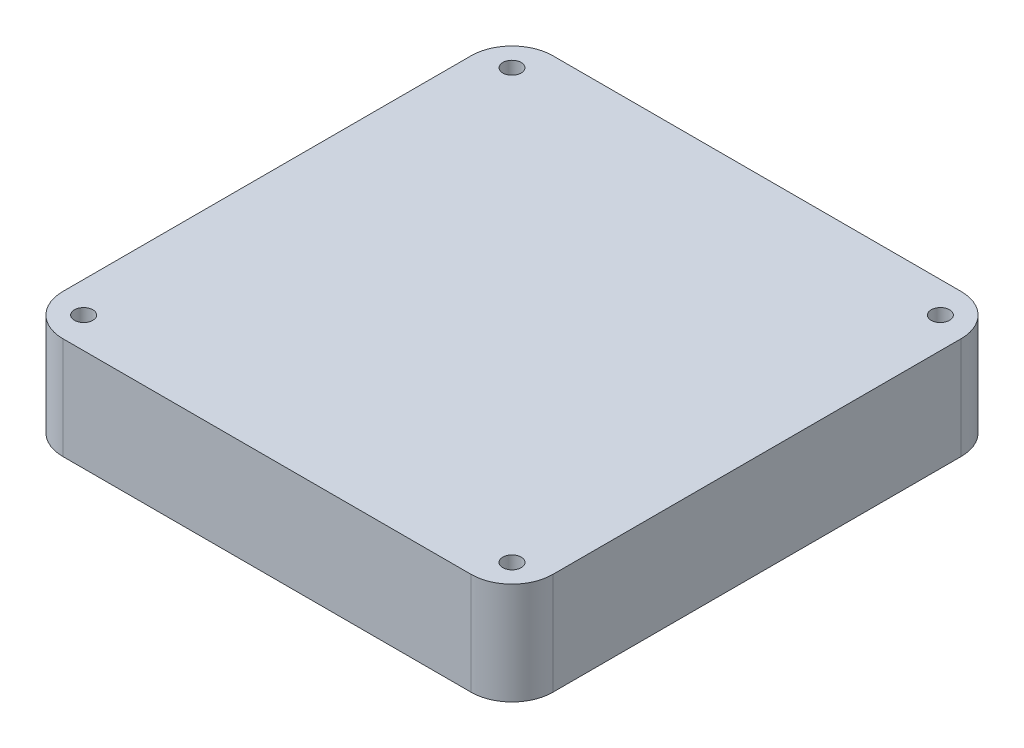
ISO-10303-21;
HEADER;
FILE_DESCRIPTION(('STEP AP214'),'2;1');
FILE_NAME('part.step','',(''),(''),'','','');
FILE_SCHEMA(('AUTOMOTIVE_DESIGN { 1 0 10303 214 1 1 1 1 }'));
ENDSEC;
DATA;
#1=APPLICATION_CONTEXT('core data for automotive mechanical design processes');
#2=APPLICATION_PROTOCOL_DEFINITION('international standard','automotive_design',2000,#1);
#3=PRODUCT_CONTEXT('',#1,'mechanical');
#4=PRODUCT('Part','Part','',(#3));
#5=PRODUCT_RELATED_PRODUCT_CATEGORY('part','',(#4));
#6=PRODUCT_DEFINITION_FORMATION('','',#4);
#7=PRODUCT_DEFINITION_CONTEXT('part definition',#1,'design');
#8=PRODUCT_DEFINITION('design','',#6,#7);
#9=PRODUCT_DEFINITION_SHAPE('','',#8);
#10=(LENGTH_UNIT() NAMED_UNIT(*) SI_UNIT(.MILLI.,.METRE.));
#11=(NAMED_UNIT(*) PLANE_ANGLE_UNIT() SI_UNIT($,.RADIAN.));
#12=(NAMED_UNIT(*) SI_UNIT($,.STERADIAN.) SOLID_ANGLE_UNIT());
#13=UNCERTAINTY_MEASURE_WITH_UNIT(LENGTH_MEASURE(1.E-05),#10,'distance_accuracy_value','');
#14=(GEOMETRIC_REPRESENTATION_CONTEXT(3) GLOBAL_UNCERTAINTY_ASSIGNED_CONTEXT((#13)) GLOBAL_UNIT_ASSIGNED_CONTEXT((#10,
#11,#12)) REPRESENTATION_CONTEXT('',''));
#15=CARTESIAN_POINT('',(0.,0.,0.));
#16=DIRECTION('',(0.,0.,1.));
#17=DIRECTION('',(1.,0.,0.));
#18=AXIS2_PLACEMENT_3D('',#15,#16,#17);
#19=CARTESIAN_POINT('',(0.,25.,0.));
#20=DIRECTION('',(0.,-1.,0.));
#21=DIRECTION('',(0.,0.,-1.));
#22=AXIS2_PLACEMENT_3D('',#19,#20,#21);
#23=PLANE('',#22);
#24=DIRECTION('',(-1.,0.,0.));
#25=VECTOR('',#24,1.);
#26=CARTESIAN_POINT('',(0.,25.,-120.));
#27=LINE('',#26,#25);
#28=CARTESIAN_POINT('',(110.,25.,-120.));
#29=VERTEX_POINT('',#28);
#30=CARTESIAN_POINT('',(10.,25.,-120.));
#31=VERTEX_POINT('',#30);
#32=EDGE_CURVE('E137',#29,#31,#27,.T.);
#33=ORIENTED_EDGE('',*,*,#32,.T.);
#34=CARTESIAN_POINT('',(10.,25.,-110.));
#35=DIRECTION('',(0.,-1.,0.));
#36=DIRECTION('',(0.,0.,-1.));
#37=AXIS2_PLACEMENT_3D('',#34,#35,#36);
#38=CIRCLE('',#37,10.);
#39=CARTESIAN_POINT('',(0.,25.,-110.));
#40=VERTEX_POINT('',#39);
#41=EDGE_CURVE('E156',#31,#40,#38,.F.);
#42=ORIENTED_EDGE('',*,*,#41,.T.);
#43=DIRECTION('',(0.,0.,1.));
#44=VECTOR('',#43,1.);
#45=CARTESIAN_POINT('',(0.,25.,0.));
#46=LINE('',#45,#44);
#47=CARTESIAN_POINT('',(0.,25.,-10.));
#48=VERTEX_POINT('',#47);
#49=EDGE_CURVE('E120',#40,#48,#46,.T.);
#50=ORIENTED_EDGE('',*,*,#49,.T.);
#51=CARTESIAN_POINT('',(10.,25.,-10.));
#52=DIRECTION('',(0.,-1.,0.));
#53=DIRECTION('',(0.,0.,-1.));
#54=AXIS2_PLACEMENT_3D('',#51,#52,#53);
#55=CIRCLE('',#54,10.);
#56=CARTESIAN_POINT('',(10.,25.,0.));
#57=VERTEX_POINT('',#56);
#58=EDGE_CURVE('E151',#48,#57,#55,.F.);
#59=ORIENTED_EDGE('',*,*,#58,.T.);
#60=DIRECTION('',(1.,0.,0.));
#61=VECTOR('',#60,1.);
#62=CARTESIAN_POINT('',(0.,25.,0.));
#63=LINE('',#62,#61);
#64=CARTESIAN_POINT('',(110.,25.,0.));
#65=VERTEX_POINT('',#64);
#66=EDGE_CURVE('E167',#57,#65,#63,.T.);
#67=ORIENTED_EDGE('',*,*,#66,.T.);
#68=CARTESIAN_POINT('',(110.,25.,-10.));
#69=DIRECTION('',(0.,-1.,0.));
#70=DIRECTION('',(0.,0.,-1.));
#71=AXIS2_PLACEMENT_3D('',#68,#69,#70);
#72=CIRCLE('',#71,10.);
#73=CARTESIAN_POINT('',(120.,25.,-10.));
#74=VERTEX_POINT('',#73);
#75=EDGE_CURVE('E56',#65,#74,#72,.F.);
#76=ORIENTED_EDGE('',*,*,#75,.T.);
#77=DIRECTION('',(0.,0.,-1.));
#78=VECTOR('',#77,1.);
#79=CARTESIAN_POINT('',(120.,25.,0.));
#80=LINE('',#79,#78);
#81=CARTESIAN_POINT('',(120.,25.,-110.));
#82=VERTEX_POINT('',#81);
#83=EDGE_CURVE('E175',#74,#82,#80,.T.);
#84=ORIENTED_EDGE('',*,*,#83,.T.);
#85=CARTESIAN_POINT('',(110.,25.,-110.));
#86=DIRECTION('',(0.,-1.,0.));
#87=DIRECTION('',(0.,0.,-1.));
#88=AXIS2_PLACEMENT_3D('',#85,#86,#87);
#89=CIRCLE('',#88,10.);
#90=EDGE_CURVE('E154',#82,#29,#89,.F.);
#91=ORIENTED_EDGE('',*,*,#90,.T.);
#92=EDGE_LOOP('',(#33,#42,#50,#59,#67,#76,#84,#91));
#93=FACE_BOUND('',#92,.T.);
#94=CARTESIAN_POINT('',(7.55,25.,-112.45));
#95=DIRECTION('',(0.,1.,0.));
#96=DIRECTION('',(0.,0.,1.));
#97=AXIS2_PLACEMENT_3D('',#94,#95,#96);
#98=CIRCLE('',#97,2.25);
#99=CARTESIAN_POINT('',(7.55,25.,-110.2));
#100=VERTEX_POINT('',#99);
#101=EDGE_CURVE('E128',#100,#100,#98,.T.);
#102=ORIENTED_EDGE('',*,*,#101,.F.);
#103=EDGE_LOOP('',(#102));
#104=FACE_BOUND('',#103,.T.);
#105=CARTESIAN_POINT('',(112.45,25.,-112.45));
#106=DIRECTION('',(0.,1.,0.));
#107=DIRECTION('',(0.,0.,1.));
#108=AXIS2_PLACEMENT_3D('',#105,#106,#107);
#109=CIRCLE('',#108,2.25);
#110=CARTESIAN_POINT('',(112.45,25.,-110.2));
#111=VERTEX_POINT('',#110);
#112=EDGE_CURVE('E182',#111,#111,#109,.T.);
#113=ORIENTED_EDGE('',*,*,#112,.F.);
#114=EDGE_LOOP('',(#113));
#115=FACE_BOUND('',#114,.T.);
#116=CARTESIAN_POINT('',(112.45,25.,-7.55));
#117=DIRECTION('',(0.,1.,0.));
#118=DIRECTION('',(0.,0.,1.));
#119=AXIS2_PLACEMENT_3D('',#116,#117,#118);
#120=CIRCLE('',#119,2.25);
#121=CARTESIAN_POINT('',(112.45,25.,-5.3));
#122=VERTEX_POINT('',#121);
#123=EDGE_CURVE('E187',#122,#122,#120,.T.);
#124=ORIENTED_EDGE('',*,*,#123,.F.);
#125=EDGE_LOOP('',(#124));
#126=FACE_BOUND('',#125,.T.);
#127=CARTESIAN_POINT('',(7.55,25.,-7.55));
#128=DIRECTION('',(0.,1.,0.));
#129=DIRECTION('',(0.,0.,1.));
#130=AXIS2_PLACEMENT_3D('',#127,#128,#129);
#131=CIRCLE('',#130,2.25);
#132=CARTESIAN_POINT('',(7.55,25.,-5.29999999999999));
#133=VERTEX_POINT('',#132);
#134=EDGE_CURVE('E193',#133,#133,#131,.T.);
#135=ORIENTED_EDGE('',*,*,#134,.F.);
#136=EDGE_LOOP('',(#135));
#137=FACE_BOUND('',#136,.T.);
#138=ADVANCED_FACE('F34',(#93,#104,#115,#126,#137),#23,.F.);
#139=CARTESIAN_POINT('',(0.,0.,0.));
#140=DIRECTION('',(0.,-1.,0.));
#141=DIRECTION('',(0.,0.,-1.));
#142=AXIS2_PLACEMENT_3D('',#139,#140,#141);
#143=PLANE('',#142);
#144=CARTESIAN_POINT('',(112.45,0.,-7.55));
#145=DIRECTION('',(0.,1.,0.));
#146=DIRECTION('',(0.,0.,1.));
#147=AXIS2_PLACEMENT_3D('',#144,#145,#146);
#148=CIRCLE('',#147,2.25);
#149=CARTESIAN_POINT('',(112.45,0.,-5.3));
#150=VERTEX_POINT('',#149);
#151=EDGE_CURVE('E190',#150,#150,#148,.T.);
#152=ORIENTED_EDGE('',*,*,#151,.T.);
#153=EDGE_LOOP('',(#152));
#154=FACE_BOUND('',#153,.T.);
#155=CARTESIAN_POINT('',(7.55,0.,-112.45));
#156=DIRECTION('',(0.,1.,0.));
#157=DIRECTION('',(0.,0.,1.));
#158=AXIS2_PLACEMENT_3D('',#155,#156,#157);
#159=CIRCLE('',#158,2.25);
#160=CARTESIAN_POINT('',(7.55,0.,-110.2));
#161=VERTEX_POINT('',#160);
#162=EDGE_CURVE('E134',#161,#161,#159,.T.);
#163=ORIENTED_EDGE('',*,*,#162,.T.);
#164=EDGE_LOOP('',(#163));
#165=FACE_BOUND('',#164,.T.);
#166=DIRECTION('',(0.,0.,1.));
#167=VECTOR('',#166,1.);
#168=CARTESIAN_POINT('',(0.,0.,0.));
#169=LINE('',#168,#167);
#170=CARTESIAN_POINT('',(0.,0.,-110.));
#171=VERTEX_POINT('',#170);
#172=CARTESIAN_POINT('',(0.,0.,-10.));
#173=VERTEX_POINT('',#172);
#174=EDGE_CURVE('E117',#171,#173,#169,.T.);
#175=ORIENTED_EDGE('',*,*,#174,.F.);
#176=CARTESIAN_POINT('',(10.,0.,-110.));
#177=DIRECTION('',(0.,-1.,0.));
#178=DIRECTION('',(0.,0.,-1.));
#179=AXIS2_PLACEMENT_3D('',#176,#177,#178);
#180=CIRCLE('',#179,10.);
#181=CARTESIAN_POINT('',(10.,0.,-120.));
#182=VERTEX_POINT('',#181);
#183=EDGE_CURVE('E100',#171,#182,#180,.T.);
#184=ORIENTED_EDGE('',*,*,#183,.T.);
#185=DIRECTION('',(-1.,0.,0.));
#186=VECTOR('',#185,1.);
#187=CARTESIAN_POINT('',(0.,0.,-120.));
#188=LINE('',#187,#186);
#189=CARTESIAN_POINT('',(110.,0.,-120.));
#190=VERTEX_POINT('',#189);
#191=EDGE_CURVE('E141',#190,#182,#188,.T.);
#192=ORIENTED_EDGE('',*,*,#191,.F.);
#193=CARTESIAN_POINT('',(110.,0.,-110.));
#194=DIRECTION('',(0.,-1.,0.));
#195=DIRECTION('',(0.,0.,-1.));
#196=AXIS2_PLACEMENT_3D('',#193,#194,#195);
#197=CIRCLE('',#196,10.);
#198=CARTESIAN_POINT('',(120.,0.,-110.));
#199=VERTEX_POINT('',#198);
#200=EDGE_CURVE('E111',#190,#199,#197,.T.);
#201=ORIENTED_EDGE('',*,*,#200,.T.);
#202=DIRECTION('',(0.,0.,-1.));
#203=VECTOR('',#202,1.);
#204=CARTESIAN_POINT('',(120.,0.,0.));
#205=LINE('',#204,#203);
#206=CARTESIAN_POINT('',(120.,0.,-10.));
#207=VERTEX_POINT('',#206);
#208=EDGE_CURVE('E131',#207,#199,#205,.T.);
#209=ORIENTED_EDGE('',*,*,#208,.F.);
#210=CARTESIAN_POINT('',(110.,0.,-10.));
#211=DIRECTION('',(0.,-1.,0.));
#212=DIRECTION('',(0.,0.,-1.));
#213=AXIS2_PLACEMENT_3D('',#210,#211,#212);
#214=CIRCLE('',#213,10.);
#215=CARTESIAN_POINT('',(110.,0.,0.));
#216=VERTEX_POINT('',#215);
#217=EDGE_CURVE('E145',#207,#216,#214,.T.);
#218=ORIENTED_EDGE('',*,*,#217,.T.);
#219=DIRECTION('',(1.,0.,0.));
#220=VECTOR('',#219,1.);
#221=CARTESIAN_POINT('',(0.,0.,0.));
#222=LINE('',#221,#220);
#223=CARTESIAN_POINT('',(10.,0.,0.));
#224=VERTEX_POINT('',#223);
#225=EDGE_CURVE('E127',#224,#216,#222,.T.);
#226=ORIENTED_EDGE('',*,*,#225,.F.);
#227=CARTESIAN_POINT('',(10.,0.,-10.));
#228=DIRECTION('',(0.,-1.,0.));
#229=DIRECTION('',(0.,0.,-1.));
#230=AXIS2_PLACEMENT_3D('',#227,#228,#229);
#231=CIRCLE('',#230,10.);
#232=EDGE_CURVE('E121',#224,#173,#231,.T.);
#233=ORIENTED_EDGE('',*,*,#232,.T.);
#234=EDGE_LOOP('',(#175,#184,#192,#201,#209,#218,#226,#233));
#235=FACE_BOUND('',#234,.T.);
#236=CARTESIAN_POINT('',(112.45,0.,-112.45));
#237=DIRECTION('',(0.,1.,0.));
#238=DIRECTION('',(0.,0.,1.));
#239=AXIS2_PLACEMENT_3D('',#236,#237,#238);
#240=CIRCLE('',#239,2.25);
#241=CARTESIAN_POINT('',(112.45,0.,-110.2));
#242=VERTEX_POINT('',#241);
#243=EDGE_CURVE('E184',#242,#242,#240,.T.);
#244=ORIENTED_EDGE('',*,*,#243,.T.);
#245=EDGE_LOOP('',(#244));
#246=FACE_BOUND('',#245,.T.);
#247=CARTESIAN_POINT('',(7.55,0.,-7.55));
#248=DIRECTION('',(0.,1.,0.));
#249=DIRECTION('',(0.,0.,1.));
#250=AXIS2_PLACEMENT_3D('',#247,#248,#249);
#251=CIRCLE('',#250,2.25);
#252=CARTESIAN_POINT('',(7.55,0.,-5.29999999999999));
#253=VERTEX_POINT('',#252);
#254=EDGE_CURVE('E196',#253,#253,#251,.T.);
#255=ORIENTED_EDGE('',*,*,#254,.T.);
#256=EDGE_LOOP('',(#255));
#257=FACE_BOUND('',#256,.T.);
#258=ADVANCED_FACE('F124',(#154,#165,#235,#246,#257),#143,.T.);
#259=CARTESIAN_POINT('',(0.,25.,0.));
#260=DIRECTION('',(1.,0.,0.));
#261=DIRECTION('',(0.,0.,-1.));
#262=AXIS2_PLACEMENT_3D('',#259,#260,#261);
#263=PLANE('',#262);
#264=ORIENTED_EDGE('',*,*,#49,.F.);
#265=DIRECTION('',(0.,-1.,0.));
#266=VECTOR('',#265,1.);
#267=CARTESIAN_POINT('',(0.,25.,-110.));
#268=LINE('',#267,#266);
#269=EDGE_CURVE('E104',#40,#171,#268,.T.);
#270=ORIENTED_EDGE('',*,*,#269,.T.);
#271=ORIENTED_EDGE('',*,*,#174,.T.);
#272=DIRECTION('',(0.,-1.,0.));
#273=VECTOR('',#272,1.);
#274=CARTESIAN_POINT('',(0.,25.,-10.));
#275=LINE('',#274,#273);
#276=EDGE_CURVE('E122',#173,#48,#275,.F.);
#277=ORIENTED_EDGE('',*,*,#276,.T.);
#278=EDGE_LOOP('',(#264,#270,#271,#277));
#279=FACE_BOUND('',#278,.T.);
#280=ADVANCED_FACE('F116',(#279),#263,.F.);
#281=CARTESIAN_POINT('',(0.,25.,0.));
#282=DIRECTION('',(0.,0.,-1.));
#283=DIRECTION('',(-1.,0.,0.));
#284=AXIS2_PLACEMENT_3D('',#281,#282,#283);
#285=PLANE('',#284);
#286=ORIENTED_EDGE('',*,*,#225,.T.);
#287=DIRECTION('',(0.,-1.,0.));
#288=VECTOR('',#287,1.);
#289=CARTESIAN_POINT('',(110.,25.,0.));
#290=LINE('',#289,#288);
#291=EDGE_CURVE('E11',#216,#65,#290,.F.);
#292=ORIENTED_EDGE('',*,*,#291,.T.);
#293=ORIENTED_EDGE('',*,*,#66,.F.);
#294=DIRECTION('',(0.,-1.,0.));
#295=VECTOR('',#294,1.);
#296=CARTESIAN_POINT('',(10.,25.,0.));
#297=LINE('',#296,#295);
#298=EDGE_CURVE('E42',#57,#224,#297,.T.);
#299=ORIENTED_EDGE('',*,*,#298,.T.);
#300=EDGE_LOOP('',(#286,#292,#293,#299));
#301=FACE_BOUND('',#300,.T.);
#302=ADVANCED_FACE('F165',(#301),#285,.F.);
#303=CARTESIAN_POINT('',(120.,25.,0.));
#304=DIRECTION('',(-1.,0.,0.));
#305=DIRECTION('',(0.,0.,1.));
#306=AXIS2_PLACEMENT_3D('',#303,#304,#305);
#307=PLANE('',#306);
#308=ORIENTED_EDGE('',*,*,#208,.T.);
#309=DIRECTION('',(0.,-1.,0.));
#310=VECTOR('',#309,1.);
#311=CARTESIAN_POINT('',(120.,25.,-110.));
#312=LINE('',#311,#310);
#313=EDGE_CURVE('E49',#199,#82,#312,.F.);
#314=ORIENTED_EDGE('',*,*,#313,.T.);
#315=ORIENTED_EDGE('',*,*,#83,.F.);
#316=DIRECTION('',(0.,-1.,0.));
#317=VECTOR('',#316,1.);
#318=CARTESIAN_POINT('',(120.,25.,-10.));
#319=LINE('',#318,#317);
#320=EDGE_CURVE('E158',#74,#207,#319,.T.);
#321=ORIENTED_EDGE('',*,*,#320,.T.);
#322=EDGE_LOOP('',(#308,#314,#315,#321));
#323=FACE_BOUND('',#322,.T.);
#324=ADVANCED_FACE('F174',(#323),#307,.F.);
#325=CARTESIAN_POINT('',(0.,25.,-120.));
#326=DIRECTION('',(0.,0.,1.));
#327=DIRECTION('',(1.,0.,0.));
#328=AXIS2_PLACEMENT_3D('',#325,#326,#327);
#329=PLANE('',#328);
#330=ORIENTED_EDGE('',*,*,#191,.T.);
#331=DIRECTION('',(0.,-1.,0.));
#332=VECTOR('',#331,1.);
#333=CARTESIAN_POINT('',(10.,25.,-120.));
#334=LINE('',#333,#332);
#335=EDGE_CURVE('E105',#182,#31,#334,.F.);
#336=ORIENTED_EDGE('',*,*,#335,.T.);
#337=ORIENTED_EDGE('',*,*,#32,.F.);
#338=DIRECTION('',(0.,-1.,0.));
#339=VECTOR('',#338,1.);
#340=CARTESIAN_POINT('',(110.,25.,-120.));
#341=LINE('',#340,#339);
#342=EDGE_CURVE('E110',#29,#190,#341,.T.);
#343=ORIENTED_EDGE('',*,*,#342,.T.);
#344=EDGE_LOOP('',(#330,#336,#337,#343));
#345=FACE_BOUND('',#344,.T.);
#346=ADVANCED_FACE('F217',(#345),#329,.F.);
#347=CARTESIAN_POINT('',(7.55,25.,-112.45));
#348=DIRECTION('',(0.,-1.,0.));
#349=DIRECTION('',(0.,0.,-1.));
#350=AXIS2_PLACEMENT_3D('',#347,#348,#349);
#351=CYLINDRICAL_SURFACE('',#350,2.25);
#352=ORIENTED_EDGE('',*,*,#101,.T.);
#353=EDGE_LOOP('',(#352));
#354=FACE_BOUND('',#353,.T.);
#355=ORIENTED_EDGE('',*,*,#162,.F.);
#356=EDGE_LOOP('',(#355));
#357=FACE_BOUND('',#356,.T.);
#358=ADVANCED_FACE('F214',(#354,#357),#351,.F.);
#359=CARTESIAN_POINT('',(112.45,25.,-112.45));
#360=DIRECTION('',(0.,-1.,0.));
#361=DIRECTION('',(0.,0.,-1.));
#362=AXIS2_PLACEMENT_3D('',#359,#360,#361);
#363=CYLINDRICAL_SURFACE('',#362,2.25);
#364=ORIENTED_EDGE('',*,*,#112,.T.);
#365=EDGE_LOOP('',(#364));
#366=FACE_BOUND('',#365,.T.);
#367=ORIENTED_EDGE('',*,*,#243,.F.);
#368=EDGE_LOOP('',(#367));
#369=FACE_BOUND('',#368,.T.);
#370=ADVANCED_FACE('F310',(#366,#369),#363,.F.);
#371=CARTESIAN_POINT('',(112.45,25.,-7.55));
#372=DIRECTION('',(0.,-1.,0.));
#373=DIRECTION('',(0.,0.,-1.));
#374=AXIS2_PLACEMENT_3D('',#371,#372,#373);
#375=CYLINDRICAL_SURFACE('',#374,2.25);
#376=ORIENTED_EDGE('',*,*,#123,.T.);
#377=EDGE_LOOP('',(#376));
#378=FACE_BOUND('',#377,.T.);
#379=ORIENTED_EDGE('',*,*,#151,.F.);
#380=EDGE_LOOP('',(#379));
#381=FACE_BOUND('',#380,.T.);
#382=ADVANCED_FACE('F301',(#378,#381),#375,.F.);
#383=CARTESIAN_POINT('',(7.55,25.,-7.55));
#384=DIRECTION('',(0.,-1.,0.));
#385=DIRECTION('',(0.,0.,-1.));
#386=AXIS2_PLACEMENT_3D('',#383,#384,#385);
#387=CYLINDRICAL_SURFACE('',#386,2.25);
#388=ORIENTED_EDGE('',*,*,#134,.T.);
#389=EDGE_LOOP('',(#388));
#390=FACE_BOUND('',#389,.T.);
#391=ORIENTED_EDGE('',*,*,#254,.F.);
#392=EDGE_LOOP('',(#391));
#393=FACE_BOUND('',#392,.T.);
#394=ADVANCED_FACE('F202',(#390,#393),#387,.F.);
#395=CARTESIAN_POINT('',(10.,25.,-110.));
#396=DIRECTION('',(0.,-1.,0.));
#397=DIRECTION('',(0.,0.,-1.));
#398=AXIS2_PLACEMENT_3D('',#395,#396,#397);
#399=CYLINDRICAL_SURFACE('',#398,10.);
#400=ORIENTED_EDGE('',*,*,#41,.F.);
#401=ORIENTED_EDGE('',*,*,#335,.F.);
#402=ORIENTED_EDGE('',*,*,#183,.F.);
#403=ORIENTED_EDGE('',*,*,#269,.F.);
#404=EDGE_LOOP('',(#400,#401,#402,#403));
#405=FACE_BOUND('',#404,.T.);
#406=ADVANCED_FACE('F103',(#405),#399,.T.);
#407=CARTESIAN_POINT('',(110.,25.,-110.));
#408=DIRECTION('',(0.,-1.,0.));
#409=DIRECTION('',(0.,0.,-1.));
#410=AXIS2_PLACEMENT_3D('',#407,#408,#409);
#411=CYLINDRICAL_SURFACE('',#410,10.);
#412=ORIENTED_EDGE('',*,*,#90,.F.);
#413=ORIENTED_EDGE('',*,*,#313,.F.);
#414=ORIENTED_EDGE('',*,*,#200,.F.);
#415=ORIENTED_EDGE('',*,*,#342,.F.);
#416=EDGE_LOOP('',(#412,#413,#414,#415));
#417=FACE_BOUND('',#416,.T.);
#418=ADVANCED_FACE('F229',(#417),#411,.T.);
#419=CARTESIAN_POINT('',(110.,25.,-10.));
#420=DIRECTION('',(0.,-1.,0.));
#421=DIRECTION('',(0.,0.,-1.));
#422=AXIS2_PLACEMENT_3D('',#419,#420,#421);
#423=CYLINDRICAL_SURFACE('',#422,10.);
#424=ORIENTED_EDGE('',*,*,#75,.F.);
#425=ORIENTED_EDGE('',*,*,#291,.F.);
#426=ORIENTED_EDGE('',*,*,#217,.F.);
#427=ORIENTED_EDGE('',*,*,#320,.F.);
#428=EDGE_LOOP('',(#424,#425,#426,#427));
#429=FACE_BOUND('',#428,.T.);
#430=ADVANCED_FACE('F173',(#429),#423,.T.);
#431=CARTESIAN_POINT('',(10.,25.,-10.));
#432=DIRECTION('',(0.,-1.,0.));
#433=DIRECTION('',(0.,0.,-1.));
#434=AXIS2_PLACEMENT_3D('',#431,#432,#433);
#435=CYLINDRICAL_SURFACE('',#434,10.);
#436=ORIENTED_EDGE('',*,*,#58,.F.);
#437=ORIENTED_EDGE('',*,*,#276,.F.);
#438=ORIENTED_EDGE('',*,*,#232,.F.);
#439=ORIENTED_EDGE('',*,*,#298,.F.);
#440=EDGE_LOOP('',(#436,#437,#438,#439));
#441=FACE_BOUND('',#440,.T.);
#442=ADVANCED_FACE('F36',(#441),#435,.T.);
#443=CLOSED_SHELL('',(#138,#258,#280,#302,#324,#346,#358,#370,#382,#394,#406,#418,#430,#442));
#444=MANIFOLD_SOLID_BREP('B2',#443);
#445=ADVANCED_BREP_SHAPE_REPRESENTATION('',(#18,#444),#14);
#446=SHAPE_DEFINITION_REPRESENTATION(#9,#445);
ENDSEC;
END-ISO-10303-21;
